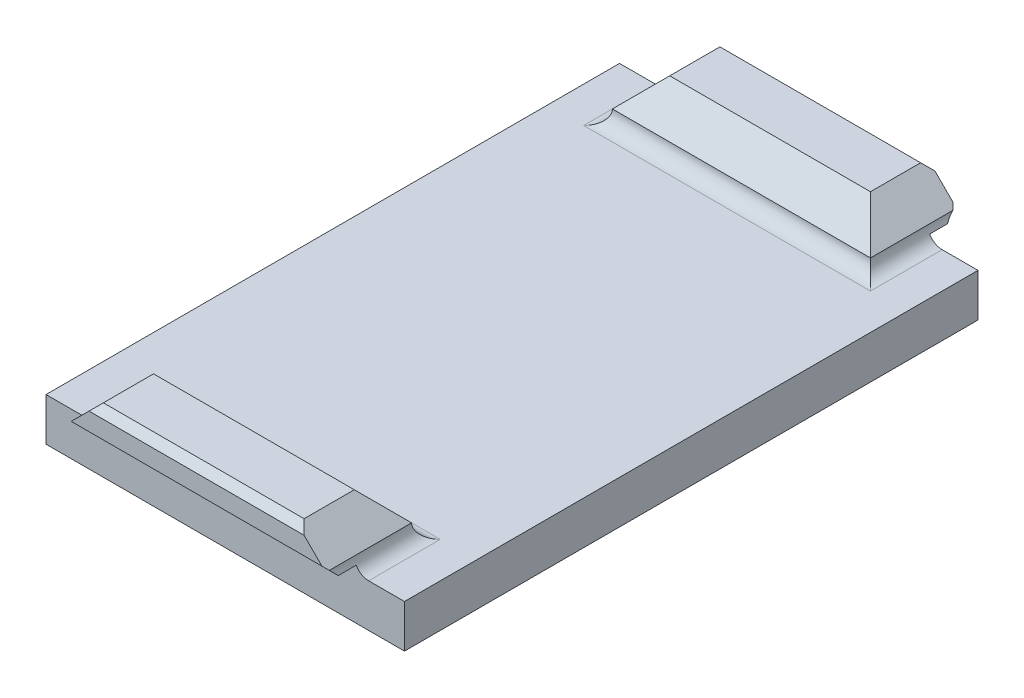
ISO-10303-21;
HEADER;
FILE_DESCRIPTION(('STEP AP214'),'2;1');
FILE_NAME('part.step','',(''),(''),'','','');
FILE_SCHEMA(('AUTOMOTIVE_DESIGN { 1 0 10303 214 1 1 1 1 }'));
ENDSEC;
DATA;
#1=APPLICATION_CONTEXT('core data for automotive mechanical design processes');
#2=APPLICATION_PROTOCOL_DEFINITION('international standard','automotive_design',2000,#1);
#3=PRODUCT_CONTEXT('',#1,'mechanical');
#4=PRODUCT('Part','Part','',(#3));
#5=PRODUCT_RELATED_PRODUCT_CATEGORY('part','',(#4));
#6=PRODUCT_DEFINITION_FORMATION('','',#4);
#7=PRODUCT_DEFINITION_CONTEXT('part definition',#1,'design');
#8=PRODUCT_DEFINITION('design','',#6,#7);
#9=PRODUCT_DEFINITION_SHAPE('','',#8);
#10=(LENGTH_UNIT() NAMED_UNIT(*) SI_UNIT(.MILLI.,.METRE.));
#11=(NAMED_UNIT(*) PLANE_ANGLE_UNIT() SI_UNIT($,.RADIAN.));
#12=(NAMED_UNIT(*) SI_UNIT($,.STERADIAN.) SOLID_ANGLE_UNIT());
#13=UNCERTAINTY_MEASURE_WITH_UNIT(LENGTH_MEASURE(1.E-05),#10,'distance_accuracy_value','');
#14=(GEOMETRIC_REPRESENTATION_CONTEXT(3) GLOBAL_UNCERTAINTY_ASSIGNED_CONTEXT((#13)) GLOBAL_UNIT_ASSIGNED_CONTEXT((#10,
#11,#12)) REPRESENTATION_CONTEXT('',''));
#15=CARTESIAN_POINT('',(0.,0.,0.));
#16=DIRECTION('',(0.,0.,1.));
#17=DIRECTION('',(1.,0.,0.));
#18=AXIS2_PLACEMENT_3D('',#15,#16,#17);
#19=CARTESIAN_POINT('',(0.,0.,0.));
#20=DIRECTION('',(0.,0.,1.));
#21=DIRECTION('',(1.,0.,0.));
#22=AXIS2_PLACEMENT_3D('',#19,#20,#21);
#23=PLANE('',#22);
#24=DIRECTION('',(-1.,0.,0.));
#25=VECTOR('',#24,1.);
#26=CARTESIAN_POINT('',(4.42047040189125,18.8964718028757,0.));
#27=LINE('',#26,#25);
#28=CARTESIAN_POINT('',(4.55074060555032,18.8964718028757,0.));
#29=VERTEX_POINT('',#28);
#30=CARTESIAN_POINT('',(-13.7097998017678,18.8964718028757,0.));
#31=VERTEX_POINT('',#30);
#32=EDGE_CURVE('E265',#29,#31,#27,.T.);
#33=ORIENTED_EDGE('',*,*,#32,.F.);
#34=CARTESIAN_POINT('',(5.42047040189125,19.39,0.));
#35=DIRECTION('',(0.,0.,1.));
#36=DIRECTION('',(1.,0.,0.));
#37=AXIS2_PLACEMENT_3D('',#34,#35,#36);
#38=CIRCLE('',#37,1.);
#39=CARTESIAN_POINT('',(5.42047040189125,18.39,0.));
#40=VERTEX_POINT('',#39);
#41=EDGE_CURVE('E428',#29,#40,#38,.T.);
#42=ORIENTED_EDGE('',*,*,#41,.T.);
#43=DIRECTION('',(-1.,0.,0.));
#44=VECTOR('',#43,1.);
#45=CARTESIAN_POINT('',(-17.0795295981088,18.39,0.));
#46=LINE('',#45,#44);
#47=CARTESIAN_POINT('',(7.92047040189125,18.39,0.));
#48=VERTEX_POINT('',#47);
#49=EDGE_CURVE('E277',#48,#40,#46,.T.);
#50=ORIENTED_EDGE('',*,*,#49,.F.);
#51=DIRECTION('',(0.,1.,0.));
#52=VECTOR('',#51,1.);
#53=CARTESIAN_POINT('',(7.92047040189125,18.39,0.));
#54=LINE('',#53,#52);
#55=CARTESIAN_POINT('',(7.92047040189125,15.39,0.));
#56=VERTEX_POINT('',#55);
#57=EDGE_CURVE('E273',#56,#48,#54,.T.);
#58=ORIENTED_EDGE('',*,*,#57,.F.);
#59=DIRECTION('',(1.,0.,0.));
#60=VECTOR('',#59,1.);
#61=CARTESIAN_POINT('',(-17.0795295981088,15.39,0.));
#62=LINE('',#61,#60);
#63=CARTESIAN_POINT('',(-17.0795295981088,15.39,0.));
#64=VERTEX_POINT('',#63);
#65=EDGE_CURVE('E270',#64,#56,#62,.T.);
#66=ORIENTED_EDGE('',*,*,#65,.F.);
#67=DIRECTION('',(0.,-1.,0.));
#68=VECTOR('',#67,1.);
#69=CARTESIAN_POINT('',(-17.0795295981088,18.39,0.));
#70=LINE('',#69,#68);
#71=CARTESIAN_POINT('',(-17.0795295981088,18.39,0.));
#72=VERTEX_POINT('',#71);
#73=EDGE_CURVE('E212',#72,#64,#70,.T.);
#74=ORIENTED_EDGE('',*,*,#73,.F.);
#75=CARTESIAN_POINT('',(-14.5795295981088,18.39,0.));
#76=VERTEX_POINT('',#75);
#77=EDGE_CURVE('E276',#76,#72,#46,.T.);
#78=ORIENTED_EDGE('',*,*,#77,.F.);
#79=CARTESIAN_POINT('',(-14.5795295981088,19.39,0.));
#80=DIRECTION('',(0.,0.,1.));
#81=DIRECTION('',(1.,0.,0.));
#82=AXIS2_PLACEMENT_3D('',#79,#80,#81);
#83=CIRCLE('',#82,1.);
#84=EDGE_CURVE('E409',#76,#31,#83,.T.);
#85=ORIENTED_EDGE('',*,*,#84,.T.);
#86=EDGE_LOOP('',(#33,#42,#50,#58,#66,#74,#78,#85));
#87=FACE_BOUND('',#86,.T.);
#88=ADVANCED_FACE('F41',(#87),#23,.F.);
#89=CARTESIAN_POINT('',(-17.0795295981088,18.39,20.));
#90=DIRECTION('',(0.,-1.,0.));
#91=DIRECTION('',(0.,0.,-1.));
#92=AXIS2_PLACEMENT_3D('',#89,#90,#91);
#93=PLANE('',#92);
#94=DIRECTION('',(1.,0.,0.));
#95=VECTOR('',#94,1.);
#96=CARTESIAN_POINT('',(-13.5795295981088,18.39,5.));
#97=LINE('',#96,#95);
#98=CARTESIAN_POINT('',(5.42047040189125,18.39,5.));
#99=VERTEX_POINT('',#98);
#100=CARTESIAN_POINT('',(-14.5795295981088,18.39,5.));
#101=VERTEX_POINT('',#100);
#102=EDGE_CURVE('E403',#99,#101,#97,.F.);
#103=ORIENTED_EDGE('',*,*,#102,.T.);
#104=DIRECTION('',(0.,0.,1.));
#105=VECTOR('',#104,1.);
#106=CARTESIAN_POINT('',(-14.5795295981088,18.39,0.));
#107=LINE('',#106,#105);
#108=EDGE_CURVE('E406',#101,#76,#107,.F.);
#109=ORIENTED_EDGE('',*,*,#108,.T.);
#110=ORIENTED_EDGE('',*,*,#77,.T.);
#111=DIRECTION('',(0.,0.,-1.));
#112=VECTOR('',#111,1.);
#113=CARTESIAN_POINT('',(-17.0795295981088,18.39,20.));
#114=LINE('',#113,#112);
#115=CARTESIAN_POINT('',(-17.0795295981088,18.39,40.));
#116=VERTEX_POINT('',#115);
#117=EDGE_CURVE('E281',#116,#72,#114,.T.);
#118=ORIENTED_EDGE('',*,*,#117,.F.);
#119=DIRECTION('',(-1.,0.,0.));
#120=VECTOR('',#119,1.);
#121=CARTESIAN_POINT('',(-17.0795295981088,18.39,40.));
#122=LINE('',#121,#120);
#123=CARTESIAN_POINT('',(-14.5795295981088,18.39,40.));
#124=VERTEX_POINT('',#123);
#125=EDGE_CURVE('E229',#124,#116,#122,.T.);
#126=ORIENTED_EDGE('',*,*,#125,.F.);
#127=DIRECTION('',(0.,0.,-1.));
#128=VECTOR('',#127,1.);
#129=CARTESIAN_POINT('',(-14.5795295981088,18.39,36.));
#130=LINE('',#129,#128);
#131=CARTESIAN_POINT('',(-14.5795295981088,18.39,35.));
#132=VERTEX_POINT('',#131);
#133=EDGE_CURVE('E390',#124,#132,#130,.T.);
#134=ORIENTED_EDGE('',*,*,#133,.T.);
#135=DIRECTION('',(1.,0.,0.));
#136=VECTOR('',#135,1.);
#137=CARTESIAN_POINT('',(4.42047040189125,18.39,35.));
#138=LINE('',#137,#136);
#139=CARTESIAN_POINT('',(5.42047040189125,18.39,35.));
#140=VERTEX_POINT('',#139);
#141=EDGE_CURVE('E393',#132,#140,#138,.T.);
#142=ORIENTED_EDGE('',*,*,#141,.T.);
#143=DIRECTION('',(0.,0.,1.));
#144=VECTOR('',#143,1.);
#145=CARTESIAN_POINT('',(5.42047040189125,18.39,40.));
#146=LINE('',#145,#144);
#147=CARTESIAN_POINT('',(5.42047040189125,18.39,40.));
#148=VERTEX_POINT('',#147);
#149=EDGE_CURVE('E397',#140,#148,#146,.T.);
#150=ORIENTED_EDGE('',*,*,#149,.T.);
#151=CARTESIAN_POINT('',(7.92047040189125,18.39,40.));
#152=VERTEX_POINT('',#151);
#153=EDGE_CURVE('E239',#152,#148,#122,.T.);
#154=ORIENTED_EDGE('',*,*,#153,.F.);
#155=DIRECTION('',(0.,0.,-1.));
#156=VECTOR('',#155,1.);
#157=CARTESIAN_POINT('',(7.92047040189125,18.39,20.));
#158=LINE('',#157,#156);
#159=EDGE_CURVE('E284',#152,#48,#158,.T.);
#160=ORIENTED_EDGE('',*,*,#159,.T.);
#161=ORIENTED_EDGE('',*,*,#49,.T.);
#162=DIRECTION('',(0.,0.,-1.));
#163=VECTOR('',#162,1.);
#164=CARTESIAN_POINT('',(5.42047040189125,18.39,4.));
#165=LINE('',#164,#163);
#166=EDGE_CURVE('E400',#40,#99,#165,.F.);
#167=ORIENTED_EDGE('',*,*,#166,.T.);
#168=EDGE_LOOP('',(#103,#109,#110,#118,#126,#134,#142,#150,#154,#160,#161,#167));
#169=FACE_BOUND('',#168,.T.);
#170=ADVANCED_FACE('F490',(#169),#93,.F.);
#171=CARTESIAN_POINT('',(-17.0795295981088,18.39,20.));
#172=DIRECTION('',(1.,0.,0.));
#173=DIRECTION('',(0.,0.,-1.));
#174=AXIS2_PLACEMENT_3D('',#171,#172,#173);
#175=PLANE('',#174);
#176=ORIENTED_EDGE('',*,*,#73,.T.);
#177=DIRECTION('',(0.,0.,-1.));
#178=VECTOR('',#177,1.);
#179=CARTESIAN_POINT('',(-17.0795295981088,15.39,20.));
#180=LINE('',#179,#178);
#181=CARTESIAN_POINT('',(-17.0795295981088,15.39,40.));
#182=VERTEX_POINT('',#181);
#183=EDGE_CURVE('E205',#182,#64,#180,.T.);
#184=ORIENTED_EDGE('',*,*,#183,.F.);
#185=DIRECTION('',(0.,-1.,0.));
#186=VECTOR('',#185,1.);
#187=CARTESIAN_POINT('',(-17.0795295981088,18.39,40.));
#188=LINE('',#187,#186);
#189=EDGE_CURVE('E210',#116,#182,#188,.T.);
#190=ORIENTED_EDGE('',*,*,#189,.F.);
#191=ORIENTED_EDGE('',*,*,#117,.T.);
#192=EDGE_LOOP('',(#176,#184,#190,#191));
#193=FACE_BOUND('',#192,.T.);
#194=ADVANCED_FACE('F207',(#193),#175,.F.);
#195=CARTESIAN_POINT('',(-17.0795295981088,15.39,20.));
#196=DIRECTION('',(0.,1.,0.));
#197=DIRECTION('',(-1.,0.,0.));
#198=AXIS2_PLACEMENT_3D('',#195,#196,#197);
#199=PLANE('',#198);
#200=ORIENTED_EDGE('',*,*,#65,.T.);
#201=DIRECTION('',(0.,0.,-1.));
#202=VECTOR('',#201,1.);
#203=CARTESIAN_POINT('',(7.92047040189125,15.39,20.));
#204=LINE('',#203,#202);
#205=CARTESIAN_POINT('',(7.92047040189125,15.39,40.));
#206=VERTEX_POINT('',#205);
#207=EDGE_CURVE('E216',#206,#56,#204,.T.);
#208=ORIENTED_EDGE('',*,*,#207,.F.);
#209=DIRECTION('',(1.,0.,0.));
#210=VECTOR('',#209,1.);
#211=CARTESIAN_POINT('',(-17.0795295981088,15.39,40.));
#212=LINE('',#211,#210);
#213=EDGE_CURVE('E219',#182,#206,#212,.T.);
#214=ORIENTED_EDGE('',*,*,#213,.F.);
#215=ORIENTED_EDGE('',*,*,#183,.T.);
#216=EDGE_LOOP('',(#200,#208,#214,#215));
#217=FACE_BOUND('',#216,.T.);
#218=ADVANCED_FACE('F220',(#217),#199,.F.);
#219=CARTESIAN_POINT('',(7.92047040189125,18.39,20.));
#220=DIRECTION('',(-1.,0.,0.));
#221=DIRECTION('',(0.,0.,1.));
#222=AXIS2_PLACEMENT_3D('',#219,#220,#221);
#223=PLANE('',#222);
#224=ORIENTED_EDGE('',*,*,#57,.T.);
#225=ORIENTED_EDGE('',*,*,#159,.F.);
#226=DIRECTION('',(0.,1.,0.));
#227=VECTOR('',#226,1.);
#228=CARTESIAN_POINT('',(7.92047040189125,18.39,40.));
#229=LINE('',#228,#227);
#230=EDGE_CURVE('E225',#206,#152,#229,.T.);
#231=ORIENTED_EDGE('',*,*,#230,.F.);
#232=ORIENTED_EDGE('',*,*,#207,.T.);
#233=EDGE_LOOP('',(#224,#225,#231,#232));
#234=FACE_BOUND('',#233,.T.);
#235=ADVANCED_FACE('F500',(#234),#223,.F.);
#236=CARTESIAN_POINT('',(0.,21.39,0.));
#237=DIRECTION('',(0.,1.,0.));
#238=DIRECTION('',(0.,0.,1.));
#239=AXIS2_PLACEMENT_3D('',#236,#237,#238);
#240=PLANE('',#239);
#241=DIRECTION('',(1.,0.,0.));
#242=VECTOR('',#241,1.);
#243=CARTESIAN_POINT('',(4.42047040189125,21.39,1.99999999999999));
#244=LINE('',#243,#242);
#245=CARTESIAN_POINT('',(-11.5795295981088,21.39,1.99999999999999));
#246=VERTEX_POINT('',#245);
#247=CARTESIAN_POINT('',(2.42047040189124,21.39,1.99999999999999));
#248=VERTEX_POINT('',#247);
#249=EDGE_CURVE('E304',#246,#248,#244,.T.);
#250=ORIENTED_EDGE('',*,*,#249,.T.);
#251=DIRECTION('',(0.,0.,-1.));
#252=VECTOR('',#251,1.);
#253=CARTESIAN_POINT('',(2.42047040189124,21.39,-1.5));
#254=LINE('',#253,#252);
#255=CARTESIAN_POINT('',(2.42047040189124,21.39,-1.5));
#256=VERTEX_POINT('',#255);
#257=EDGE_CURVE('E354',#248,#256,#254,.T.);
#258=ORIENTED_EDGE('',*,*,#257,.T.);
#259=DIRECTION('',(-1.,0.,0.));
#260=VECTOR('',#259,1.);
#261=CARTESIAN_POINT('',(0.,21.39,-1.5));
#262=LINE('',#261,#260);
#263=CARTESIAN_POINT('',(-11.5795295981088,21.39,-1.5));
#264=VERTEX_POINT('',#263);
#265=EDGE_CURVE('E300',#256,#264,#262,.T.);
#266=ORIENTED_EDGE('',*,*,#265,.T.);
#267=DIRECTION('',(0.,0.,1.));
#268=VECTOR('',#267,1.);
#269=CARTESIAN_POINT('',(-11.5795295981088,21.39,1.99999999999999));
#270=LINE('',#269,#268);
#271=EDGE_CURVE('E350',#264,#246,#270,.T.);
#272=ORIENTED_EDGE('',*,*,#271,.T.);
#273=EDGE_LOOP('',(#250,#258,#266,#272));
#274=FACE_BOUND('',#273,.T.);
#275=ADVANCED_FACE('F535',(#274),#240,.T.);
#276=CARTESIAN_POINT('',(4.42047040189125,18.8964718028757,-2.));
#277=DIRECTION('',(0.,1.,0.));
#278=DIRECTION('',(0.,0.,1.));
#279=AXIS2_PLACEMENT_3D('',#276,#277,#278);
#280=PLANE('',#279);
#281=ORIENTED_EDGE('',*,*,#32,.T.);
#282=DIRECTION('',(0.,0.,-1.));
#283=VECTOR('',#282,1.);
#284=CARTESIAN_POINT('',(-13.7097998017678,18.8964718028757,0.));
#285=LINE('',#284,#283);
#286=CARTESIAN_POINT('',(-13.7097998017678,18.8964718028757,-1.25));
#287=VERTEX_POINT('',#286);
#288=EDGE_CURVE('E413',#31,#287,#285,.T.);
#289=ORIENTED_EDGE('',*,*,#288,.T.);
#290=DIRECTION('',(1.,0.,0.));
#291=VECTOR('',#290,1.);
#292=CARTESIAN_POINT('',(4.42047040189125,18.8964718028757,-1.25));
#293=LINE('',#292,#291);
#294=CARTESIAN_POINT('',(4.55074060555032,18.8964718028757,-1.25));
#295=VERTEX_POINT('',#294);
#296=EDGE_CURVE('E293',#287,#295,#293,.T.);
#297=ORIENTED_EDGE('',*,*,#296,.T.);
#298=DIRECTION('',(0.,0.,1.));
#299=VECTOR('',#298,1.);
#300=CARTESIAN_POINT('',(4.55074060555032,18.8964718028757,-1.25));
#301=LINE('',#300,#299);
#302=EDGE_CURVE('E424',#295,#29,#301,.T.);
#303=ORIENTED_EDGE('',*,*,#302,.T.);
#304=EDGE_LOOP('',(#281,#289,#297,#303));
#305=FACE_BOUND('',#304,.T.);
#306=ADVANCED_FACE('F519',(#305),#280,.F.);
#307=CARTESIAN_POINT('',(0.,0.,-2.));
#308=DIRECTION('',(0.,0.,-1.));
#309=DIRECTION('',(-1.,0.,0.));
#310=AXIS2_PLACEMENT_3D('',#307,#308,#309);
#311=PLANE('',#310);
#312=DIRECTION('',(1.,0.,0.));
#313=VECTOR('',#312,1.);
#314=CARTESIAN_POINT('',(0.,20.89,-2.));
#315=LINE('',#314,#313);
#316=CARTESIAN_POINT('',(-12.0795295981088,20.89,-2.));
#317=VERTEX_POINT('',#316);
#318=CARTESIAN_POINT('',(2.92047040189124,20.89,-2.));
#319=VERTEX_POINT('',#318);
#320=EDGE_CURVE('E296',#317,#319,#315,.T.);
#321=ORIENTED_EDGE('',*,*,#320,.T.);
#322=DIRECTION('',(0.707106781186546,-0.707106781186549,0.));
#323=VECTOR('',#322,1.);
#324=CARTESIAN_POINT('',(11.9052352009456,11.9052352009456,-2.));
#325=LINE('',#324,#323);
#326=CARTESIAN_POINT('',(4.16399859901554,19.6464718028757,-2.));
#327=VERTEX_POINT('',#326);
#328=EDGE_CURVE('E367',#319,#327,#325,.T.);
#329=ORIENTED_EDGE('',*,*,#328,.T.);
#330=DIRECTION('',(-1.,0.,0.));
#331=VECTOR('',#330,1.);
#332=CARTESIAN_POINT('',(-13.5795295981088,19.6464718028757,-2.));
#333=LINE('',#332,#331);
#334=CARTESIAN_POINT('',(-13.3230577952331,19.6464718028757,-2.));
#335=VERTEX_POINT('',#334);
#336=EDGE_CURVE('E215',#327,#335,#333,.T.);
#337=ORIENTED_EDGE('',*,*,#336,.T.);
#338=DIRECTION('',(0.707106781186546,0.707106781186549,0.));
#339=VECTOR('',#338,1.);
#340=CARTESIAN_POINT('',(-16.4847647990544,16.4847647990543,-2.));
#341=LINE('',#340,#339);
#342=EDGE_CURVE('E364',#335,#317,#341,.T.);
#343=ORIENTED_EDGE('',*,*,#342,.T.);
#344=EDGE_LOOP('',(#321,#329,#337,#343));
#345=FACE_BOUND('',#344,.T.);
#346=ADVANCED_FACE('F546',(#345),#311,.T.);
#347=CARTESIAN_POINT('',(0.,19.6464718028757,-2.));
#348=DIRECTION('',(0.,-0.707106781186549,-0.707106781186546));
#349=DIRECTION('',(1.,0.,0.));
#350=AXIS2_PLACEMENT_3D('',#347,#348,#349);
#351=PLANE('',#350);
#352=ORIENTED_EDGE('',*,*,#336,.F.);
#353=DIRECTION('',(0.577350269189624,-0.577350269189626,0.577350269189628));
#354=VECTOR('',#353,1.);
#355=CARTESIAN_POINT('',(2.77599906601037,21.0344713358809,-3.38799953300518));
#356=LINE('',#355,#354);
#357=CARTESIAN_POINT('',(4.42047040189125,19.39,-1.74352819712429));
#358=VERTEX_POINT('',#357);
#359=EDGE_CURVE('E373',#327,#358,#356,.T.);
#360=ORIENTED_EDGE('',*,*,#359,.T.);
#361=CARTESIAN_POINT('',(5.42047040189125,19.39,-1.7435281971243));
#362=DIRECTION('',(0.,-0.707106781186549,-0.707106781186546));
#363=DIRECTION('',(0.,-0.707106781186546,0.707106781186549));
#364=AXIS2_PLACEMENT_3D('',#361,#362,#363);
#365=ELLIPSE('',#364,1.4142135623731,1.);
#366=EDGE_CURVE('E420',#358,#295,#365,.F.);
#367=ORIENTED_EDGE('',*,*,#366,.T.);
#368=ORIENTED_EDGE('',*,*,#296,.F.);
#369=CARTESIAN_POINT('',(-14.5795295981088,19.39,-1.7435281971243));
#370=DIRECTION('',(0.,-0.707106781186549,-0.707106781186546));
#371=DIRECTION('',(0.,0.707106781186546,-0.707106781186549));
#372=AXIS2_PLACEMENT_3D('',#369,#370,#371);
#373=ELLIPSE('',#372,1.4142135623731,1.);
#374=CARTESIAN_POINT('',(-13.5795295981088,19.39,-1.7435281971243));
#375=VERTEX_POINT('',#374);
#376=EDGE_CURVE('E417',#287,#375,#373,.F.);
#377=ORIENTED_EDGE('',*,*,#376,.T.);
#378=DIRECTION('',(0.577350269189623,0.577350269189626,-0.577350269189628));
#379=VECTOR('',#378,1.);
#380=CARTESIAN_POINT('',(-8.88203853015541,24.0874910679533,-6.44101926507769));
#381=LINE('',#380,#379);
#382=EDGE_CURVE('E370',#375,#335,#381,.T.);
#383=ORIENTED_EDGE('',*,*,#382,.T.);
#384=EDGE_LOOP('',(#352,#360,#367,#368,#377,#383));
#385=FACE_BOUND('',#384,.T.);
#386=ADVANCED_FACE('F522',(#385),#351,.T.);
#387=CARTESIAN_POINT('',(0.,20.89,-2.));
#388=DIRECTION('',(0.,-0.70710678118655,0.707106781186545));
#389=DIRECTION('',(1.,0.,0.));
#390=AXIS2_PLACEMENT_3D('',#387,#388,#389);
#391=PLANE('',#390);
#392=ORIENTED_EDGE('',*,*,#265,.F.);
#393=DIRECTION('',(-0.577350269189623,0.577350269189625,0.577350269189629));
#394=VECTOR('',#393,1.);
#395=CARTESIAN_POINT('',(1.9469802679275,21.8634901339637,-1.02650986603625));
#396=LINE('',#395,#394);
#397=EDGE_CURVE('E361',#256,#319,#396,.F.);
#398=ORIENTED_EDGE('',*,*,#397,.T.);
#399=ORIENTED_EDGE('',*,*,#320,.F.);
#400=DIRECTION('',(-0.577350269189623,-0.577350269189625,-0.577350269189629));
#401=VECTOR('',#400,1.);
#402=CARTESIAN_POINT('',(-8.05301973207254,24.9165098660362,2.02650986603626));
#403=LINE('',#402,#401);
#404=EDGE_CURVE('E358',#317,#264,#403,.F.);
#405=ORIENTED_EDGE('',*,*,#404,.T.);
#406=EDGE_LOOP('',(#392,#398,#399,#405));
#407=FACE_BOUND('',#406,.T.);
#408=ADVANCED_FACE('F538',(#407),#391,.F.);
#409=CARTESIAN_POINT('',(0.,21.39,1.99999999999999));
#410=DIRECTION('',(0.,0.707106781186546,0.707106781186549));
#411=DIRECTION('',(-1.,0.,0.));
#412=AXIS2_PLACEMENT_3D('',#409,#410,#411);
#413=PLANE('',#412);
#414=DIRECTION('',(-1.,0.,0.));
#415=VECTOR('',#414,1.);
#416=CARTESIAN_POINT('',(-13.5795295981088,19.39,4.));
#417=LINE('',#416,#415);
#418=CARTESIAN_POINT('',(4.42047040189125,19.39,4.));
#419=VERTEX_POINT('',#418);
#420=CARTESIAN_POINT('',(-13.5795295981088,19.39,4.));
#421=VERTEX_POINT('',#420);
#422=EDGE_CURVE('E308',#419,#421,#417,.T.);
#423=ORIENTED_EDGE('',*,*,#422,.F.);
#424=DIRECTION('',(-0.577350269189625,0.577350269189627,-0.577350269189625));
#425=VECTOR('',#424,1.);
#426=CARTESIAN_POINT('',(1.61364693459416,22.1968234672971,1.19317653270292));
#427=LINE('',#426,#425);
#428=EDGE_CURVE('E383',#419,#248,#427,.T.);
#429=ORIENTED_EDGE('',*,*,#428,.T.);
#430=ORIENTED_EDGE('',*,*,#249,.F.);
#431=DIRECTION('',(-0.577350269189625,-0.577350269189627,0.577350269189625));
#432=VECTOR('',#431,1.);
#433=CARTESIAN_POINT('',(-7.71968639873918,25.2498431993696,-1.85984319936958));
#434=LINE('',#433,#432);
#435=EDGE_CURVE('E380',#246,#421,#434,.T.);
#436=ORIENTED_EDGE('',*,*,#435,.T.);
#437=EDGE_LOOP('',(#423,#429,#430,#436));
#438=FACE_BOUND('',#437,.T.);
#439=ADVANCED_FACE('F528',(#438),#413,.T.);
#440=CARTESIAN_POINT('',(0.,0.,40.));
#441=DIRECTION('',(0.,0.,-1.));
#442=DIRECTION('',(1.,0.,0.));
#443=AXIS2_PLACEMENT_3D('',#440,#441,#442);
#444=PLANE('',#443);
#445=DIRECTION('',(-1.,0.,0.));
#446=VECTOR('',#445,1.);
#447=CARTESIAN_POINT('',(4.42047040189125,18.8964718028757,40.));
#448=LINE('',#447,#446);
#449=CARTESIAN_POINT('',(4.55074060555032,18.8964718028757,40.));
#450=VERTEX_POINT('',#449);
#451=CARTESIAN_POINT('',(-13.7097998017678,18.8964718028757,40.));
#452=VERTEX_POINT('',#451);
#453=EDGE_CURVE('E58',#450,#452,#448,.T.);
#454=ORIENTED_EDGE('',*,*,#453,.T.);
#455=CARTESIAN_POINT('',(-14.5795295981088,19.39,40.));
#456=DIRECTION('',(0.,0.,-1.));
#457=DIRECTION('',(-1.,0.,0.));
#458=AXIS2_PLACEMENT_3D('',#455,#456,#457);
#459=CIRCLE('',#458,1.);
#460=EDGE_CURVE('E11',#452,#124,#459,.T.);
#461=ORIENTED_EDGE('',*,*,#460,.T.);
#462=ORIENTED_EDGE('',*,*,#125,.T.);
#463=ORIENTED_EDGE('',*,*,#189,.T.);
#464=ORIENTED_EDGE('',*,*,#213,.T.);
#465=ORIENTED_EDGE('',*,*,#230,.T.);
#466=ORIENTED_EDGE('',*,*,#153,.T.);
#467=CARTESIAN_POINT('',(5.42047040189125,19.39,40.));
#468=DIRECTION('',(0.,0.,-1.));
#469=DIRECTION('',(-1.,0.,0.));
#470=AXIS2_PLACEMENT_3D('',#467,#468,#469);
#471=CIRCLE('',#470,1.);
#472=EDGE_CURVE('E431',#148,#450,#471,.T.);
#473=ORIENTED_EDGE('',*,*,#472,.T.);
#474=EDGE_LOOP('',(#454,#461,#462,#463,#464,#465,#466,#473));
#475=FACE_BOUND('',#474,.T.);
#476=ADVANCED_FACE('F227',(#475),#444,.F.);
#477=CARTESIAN_POINT('',(0.,21.39,40.));
#478=DIRECTION('',(0.,1.,0.));
#479=DIRECTION('',(0.,0.,-1.));
#480=AXIS2_PLACEMENT_3D('',#477,#478,#479);
#481=PLANE('',#480);
#482=DIRECTION('',(-1.,0.,0.));
#483=VECTOR('',#482,1.);
#484=CARTESIAN_POINT('',(0.,21.39,41.5));
#485=LINE('',#484,#483);
#486=CARTESIAN_POINT('',(2.42047040189124,21.39,41.5));
#487=VERTEX_POINT('',#486);
#488=CARTESIAN_POINT('',(-11.5795295981087,21.39,41.5));
#489=VERTEX_POINT('',#488);
#490=EDGE_CURVE('E253',#487,#489,#485,.T.);
#491=ORIENTED_EDGE('',*,*,#490,.F.);
#492=DIRECTION('',(0.,0.,-1.));
#493=VECTOR('',#492,1.);
#494=CARTESIAN_POINT('',(2.42047040189124,21.39,38.));
#495=LINE('',#494,#493);
#496=CARTESIAN_POINT('',(2.42047040189124,21.39,38.));
#497=VERTEX_POINT('',#496);
#498=EDGE_CURVE('E337',#487,#497,#495,.T.);
#499=ORIENTED_EDGE('',*,*,#498,.T.);
#500=DIRECTION('',(1.,0.,0.));
#501=VECTOR('',#500,1.);
#502=CARTESIAN_POINT('',(4.42047040189125,21.39,38.));
#503=LINE('',#502,#501);
#504=CARTESIAN_POINT('',(-11.5795295981087,21.39,38.));
#505=VERTEX_POINT('',#504);
#506=EDGE_CURVE('E257',#505,#497,#503,.T.);
#507=ORIENTED_EDGE('',*,*,#506,.F.);
#508=DIRECTION('',(0.,0.,1.));
#509=VECTOR('',#508,1.);
#510=CARTESIAN_POINT('',(-11.5795295981087,21.39,41.5));
#511=LINE('',#510,#509);
#512=EDGE_CURVE('E334',#505,#489,#511,.T.);
#513=ORIENTED_EDGE('',*,*,#512,.T.);
#514=EDGE_LOOP('',(#491,#499,#507,#513));
#515=FACE_BOUND('',#514,.T.);
#516=ADVANCED_FACE('F681',(#515),#481,.T.);
#517=CARTESIAN_POINT('',(4.42047040189125,18.8964718028757,42.));
#518=DIRECTION('',(0.,1.,0.));
#519=DIRECTION('',(0.,0.,-1.));
#520=AXIS2_PLACEMENT_3D('',#517,#518,#519);
#521=PLANE('',#520);
#522=DIRECTION('',(1.,0.,0.));
#523=VECTOR('',#522,1.);
#524=CARTESIAN_POINT('',(4.42047040189125,18.8964718028757,41.25));
#525=LINE('',#524,#523);
#526=CARTESIAN_POINT('',(-13.7097998017678,18.8964718028757,41.25));
#527=VERTEX_POINT('',#526);
#528=CARTESIAN_POINT('',(4.55074060555032,18.8964718028757,41.25));
#529=VERTEX_POINT('',#528);
#530=EDGE_CURVE('E65',#527,#529,#525,.T.);
#531=ORIENTED_EDGE('',*,*,#530,.F.);
#532=DIRECTION('',(0.,0.,1.));
#533=VECTOR('',#532,1.);
#534=CARTESIAN_POINT('',(-13.7097998017678,18.8964718028757,41.25));
#535=LINE('',#534,#533);
#536=EDGE_CURVE('E51',#527,#452,#535,.F.);
#537=ORIENTED_EDGE('',*,*,#536,.T.);
#538=ORIENTED_EDGE('',*,*,#453,.F.);
#539=DIRECTION('',(0.,0.,-1.));
#540=VECTOR('',#539,1.);
#541=CARTESIAN_POINT('',(4.55074060555032,18.8964718028757,40.));
#542=LINE('',#541,#540);
#543=EDGE_CURVE('E434',#450,#529,#542,.F.);
#544=ORIENTED_EDGE('',*,*,#543,.T.);
#545=EDGE_LOOP('',(#531,#537,#538,#544));
#546=FACE_BOUND('',#545,.T.);
#547=ADVANCED_FACE('F673',(#546),#521,.F.);
#548=CARTESIAN_POINT('',(0.,0.,42.));
#549=DIRECTION('',(0.,0.,1.));
#550=DIRECTION('',(-1.,0.,0.));
#551=AXIS2_PLACEMENT_3D('',#548,#549,#550);
#552=PLANE('',#551);
#553=DIRECTION('',(-1.,0.,0.));
#554=VECTOR('',#553,1.);
#555=CARTESIAN_POINT('',(-13.5795295981088,19.6464718028757,42.));
#556=LINE('',#555,#554);
#557=CARTESIAN_POINT('',(4.16399859901555,19.6464718028757,42.));
#558=VERTEX_POINT('',#557);
#559=CARTESIAN_POINT('',(-13.3230577952331,19.6464718028757,42.));
#560=VERTEX_POINT('',#559);
#561=EDGE_CURVE('E243',#558,#560,#556,.T.);
#562=ORIENTED_EDGE('',*,*,#561,.F.);
#563=DIRECTION('',(-0.707106781186549,0.707106781186546,0.));
#564=VECTOR('',#563,1.);
#565=CARTESIAN_POINT('',(11.9052352009456,11.9052352009457,42.));
#566=LINE('',#565,#564);
#567=CARTESIAN_POINT('',(2.92047040189124,20.89,42.));
#568=VERTEX_POINT('',#567);
#569=EDGE_CURVE('E325',#558,#568,#566,.T.);
#570=ORIENTED_EDGE('',*,*,#569,.T.);
#571=DIRECTION('',(1.,0.,0.));
#572=VECTOR('',#571,1.);
#573=CARTESIAN_POINT('',(0.,20.89,42.));
#574=LINE('',#573,#572);
#575=CARTESIAN_POINT('',(-12.0795295981087,20.89,42.));
#576=VERTEX_POINT('',#575);
#577=EDGE_CURVE('E249',#576,#568,#574,.T.);
#578=ORIENTED_EDGE('',*,*,#577,.F.);
#579=DIRECTION('',(-0.707106781186549,-0.707106781186546,0.));
#580=VECTOR('',#579,1.);
#581=CARTESIAN_POINT('',(-16.4847647990543,16.4847647990544,42.));
#582=LINE('',#581,#580);
#583=EDGE_CURVE('E322',#576,#560,#582,.T.);
#584=ORIENTED_EDGE('',*,*,#583,.T.);
#585=EDGE_LOOP('',(#562,#570,#578,#584));
#586=FACE_BOUND('',#585,.T.);
#587=ADVANCED_FACE('F665',(#586),#552,.T.);
#588=CARTESIAN_POINT('',(0.,19.6464718028757,42.));
#589=DIRECTION('',(0.,-0.707106781186549,0.707106781186546));
#590=DIRECTION('',(1.,0.,0.));
#591=AXIS2_PLACEMENT_3D('',#588,#589,#590);
#592=PLANE('',#591);
#593=ORIENTED_EDGE('',*,*,#530,.T.);
#594=CARTESIAN_POINT('',(5.42047040189125,19.39,41.7435281971243));
#595=DIRECTION('',(0.,-0.707106781186549,0.707106781186546));
#596=DIRECTION('',(0.,-0.707106781186546,-0.707106781186549));
#597=AXIS2_PLACEMENT_3D('',#594,#595,#596);
#598=ELLIPSE('',#597,1.4142135623731,1.);
#599=CARTESIAN_POINT('',(4.42047040189125,19.39,41.7435281971243));
#600=VERTEX_POINT('',#599);
#601=EDGE_CURVE('E437',#529,#600,#598,.F.);
#602=ORIENTED_EDGE('',*,*,#601,.T.);
#603=DIRECTION('',(-0.577350269189626,0.577350269189624,0.577350269189627));
#604=VECTOR('',#603,1.);
#605=CARTESIAN_POINT('',(2.77599906601036,21.0344713358809,43.3879995330052));
#606=LINE('',#605,#604);
#607=EDGE_CURVE('E319',#600,#558,#606,.T.);
#608=ORIENTED_EDGE('',*,*,#607,.T.);
#609=ORIENTED_EDGE('',*,*,#561,.T.);
#610=DIRECTION('',(-0.577350269189626,-0.577350269189624,-0.577350269189627));
#611=VECTOR('',#610,1.);
#612=CARTESIAN_POINT('',(-8.88203853015536,24.0874910679534,46.4410192650777));
#613=LINE('',#612,#611);
#614=CARTESIAN_POINT('',(-13.5795295981088,19.39,41.7435281971243));
#615=VERTEX_POINT('',#614);
#616=EDGE_CURVE('E316',#560,#615,#613,.T.);
#617=ORIENTED_EDGE('',*,*,#616,.T.);
#618=CARTESIAN_POINT('',(-14.5795295981088,19.39,41.7435281971243));
#619=DIRECTION('',(0.,-0.707106781186549,0.707106781186546));
#620=DIRECTION('',(0.,0.707106781186546,0.707106781186549));
#621=AXIS2_PLACEMENT_3D('',#618,#619,#620);
#622=ELLIPSE('',#621,1.4142135623731,1.);
#623=EDGE_CURVE('E440',#615,#527,#622,.F.);
#624=ORIENTED_EDGE('',*,*,#623,.T.);
#625=EDGE_LOOP('',(#593,#602,#608,#609,#617,#624));
#626=FACE_BOUND('',#625,.T.);
#627=ADVANCED_FACE('F657',(#626),#592,.T.);
#628=CARTESIAN_POINT('',(0.,20.89,42.));
#629=DIRECTION('',(0.,-0.70710678118655,-0.707106781186545));
#630=DIRECTION('',(1.,0.,0.));
#631=AXIS2_PLACEMENT_3D('',#628,#629,#630);
#632=PLANE('',#631);
#633=ORIENTED_EDGE('',*,*,#577,.T.);
#634=DIRECTION('',(0.577350269189626,-0.577350269189624,0.577350269189628));
#635=VECTOR('',#634,1.);
#636=CARTESIAN_POINT('',(1.94698026792749,21.8634901339637,41.0265098660362));
#637=LINE('',#636,#635);
#638=EDGE_CURVE('E331',#568,#487,#637,.F.);
#639=ORIENTED_EDGE('',*,*,#638,.T.);
#640=ORIENTED_EDGE('',*,*,#490,.T.);
#641=DIRECTION('',(0.577350269189626,0.577350269189624,-0.577350269189628));
#642=VECTOR('',#641,1.);
#643=CARTESIAN_POINT('',(-8.0530197320725,24.9165098660362,37.9734901339637));
#644=LINE('',#643,#642);
#645=EDGE_CURVE('E328',#489,#576,#644,.F.);
#646=ORIENTED_EDGE('',*,*,#645,.T.);
#647=EDGE_LOOP('',(#633,#639,#640,#646));
#648=FACE_BOUND('',#647,.T.);
#649=ADVANCED_FACE('F650',(#648),#632,.F.);
#650=CARTESIAN_POINT('',(0.,21.39,38.));
#651=DIRECTION('',(0.,0.707106781186546,-0.707106781186549));
#652=DIRECTION('',(-1.,0.,0.));
#653=AXIS2_PLACEMENT_3D('',#650,#651,#652);
#654=PLANE('',#653);
#655=ORIENTED_EDGE('',*,*,#506,.T.);
#656=DIRECTION('',(0.577350269189628,-0.577350269189626,-0.577350269189624));
#657=VECTOR('',#656,1.);
#658=CARTESIAN_POINT('',(1.61364693459415,22.1968234672971,38.8068234672971));
#659=LINE('',#658,#657);
#660=CARTESIAN_POINT('',(4.42047040189125,19.39,36.));
#661=VERTEX_POINT('',#660);
#662=EDGE_CURVE('E343',#497,#661,#659,.T.);
#663=ORIENTED_EDGE('',*,*,#662,.T.);
#664=DIRECTION('',(-1.,0.,0.));
#665=VECTOR('',#664,1.);
#666=CARTESIAN_POINT('',(-13.5795295981088,19.39,36.));
#667=LINE('',#666,#665);
#668=CARTESIAN_POINT('',(-13.5795295981088,19.39,36.));
#669=VERTEX_POINT('',#668);
#670=EDGE_CURVE('E261',#661,#669,#667,.T.);
#671=ORIENTED_EDGE('',*,*,#670,.T.);
#672=DIRECTION('',(0.577350269189628,0.577350269189626,0.577350269189624));
#673=VECTOR('',#672,1.);
#674=CARTESIAN_POINT('',(-7.71968639873914,25.2498431993696,41.8598431993696));
#675=LINE('',#674,#673);
#676=EDGE_CURVE('E340',#669,#505,#675,.T.);
#677=ORIENTED_EDGE('',*,*,#676,.T.);
#678=EDGE_LOOP('',(#655,#663,#671,#677));
#679=FACE_BOUND('',#678,.T.);
#680=ADVANCED_FACE('F475',(#679),#654,.T.);
#681=CARTESIAN_POINT('',(4.42047040189125,19.39,40.));
#682=DIRECTION('',(0.707106781186546,0.707106781186549,0.));
#683=DIRECTION('',(0.,0.,-1.));
#684=AXIS2_PLACEMENT_3D('',#681,#682,#683);
#685=PLANE('',#684);
#686=ORIENTED_EDGE('',*,*,#662,.F.);
#687=ORIENTED_EDGE('',*,*,#498,.F.);
#688=ORIENTED_EDGE('',*,*,#638,.F.);
#689=ORIENTED_EDGE('',*,*,#569,.F.);
#690=ORIENTED_EDGE('',*,*,#607,.F.);
#691=DIRECTION('',(0.,0.,1.));
#692=VECTOR('',#691,1.);
#693=CARTESIAN_POINT('',(4.42047040189125,19.39,41.5));
#694=LINE('',#693,#692);
#695=EDGE_CURVE('E312',#661,#600,#694,.T.);
#696=ORIENTED_EDGE('',*,*,#695,.F.);
#697=EDGE_LOOP('',(#686,#687,#688,#689,#690,#696));
#698=FACE_BOUND('',#697,.T.);
#699=ADVANCED_FACE('F481',(#698),#685,.T.);
#700=CARTESIAN_POINT('',(-13.5795295981088,19.39,40.));
#701=DIRECTION('',(-0.707106781186546,0.707106781186549,0.));
#702=DIRECTION('',(0.,0.,1.));
#703=AXIS2_PLACEMENT_3D('',#700,#701,#702);
#704=PLANE('',#703);
#705=ORIENTED_EDGE('',*,*,#645,.F.);
#706=ORIENTED_EDGE('',*,*,#512,.F.);
#707=ORIENTED_EDGE('',*,*,#676,.F.);
#708=DIRECTION('',(0.,0.,-1.));
#709=VECTOR('',#708,1.);
#710=CARTESIAN_POINT('',(-13.5795295981088,19.39,38.));
#711=LINE('',#710,#709);
#712=EDGE_CURVE('E346',#615,#669,#711,.T.);
#713=ORIENTED_EDGE('',*,*,#712,.F.);
#714=ORIENTED_EDGE('',*,*,#616,.F.);
#715=ORIENTED_EDGE('',*,*,#583,.F.);
#716=EDGE_LOOP('',(#705,#706,#707,#713,#714,#715));
#717=FACE_BOUND('',#716,.T.);
#718=ADVANCED_FACE('F470',(#717),#704,.T.);
#719=CARTESIAN_POINT('',(2.42047040189124,21.39,0.));
#720=DIRECTION('',(0.707106781186549,0.707106781186546,0.));
#721=DIRECTION('',(0.,0.,1.));
#722=AXIS2_PLACEMENT_3D('',#719,#720,#721);
#723=PLANE('',#722);
#724=ORIENTED_EDGE('',*,*,#428,.F.);
#725=DIRECTION('',(0.,0.,1.));
#726=VECTOR('',#725,1.);
#727=CARTESIAN_POINT('',(4.42047040189125,19.39,1.99999999999999));
#728=LINE('',#727,#726);
#729=EDGE_CURVE('E376',#358,#419,#728,.T.);
#730=ORIENTED_EDGE('',*,*,#729,.F.);
#731=ORIENTED_EDGE('',*,*,#359,.F.);
#732=ORIENTED_EDGE('',*,*,#328,.F.);
#733=ORIENTED_EDGE('',*,*,#397,.F.);
#734=ORIENTED_EDGE('',*,*,#257,.F.);
#735=EDGE_LOOP('',(#724,#730,#731,#732,#733,#734));
#736=FACE_BOUND('',#735,.T.);
#737=ADVANCED_FACE('F531',(#736),#723,.T.);
#738=CARTESIAN_POINT('',(-11.5795295981088,21.39,0.));
#739=DIRECTION('',(-0.707106781186549,0.707106781186546,0.));
#740=DIRECTION('',(0.,0.,-1.));
#741=AXIS2_PLACEMENT_3D('',#738,#739,#740);
#742=PLANE('',#741);
#743=ORIENTED_EDGE('',*,*,#382,.F.);
#744=DIRECTION('',(0.,0.,-1.));
#745=VECTOR('',#744,1.);
#746=CARTESIAN_POINT('',(-13.5795295981088,19.39,-1.5));
#747=LINE('',#746,#745);
#748=EDGE_CURVE('E386',#421,#375,#747,.T.);
#749=ORIENTED_EDGE('',*,*,#748,.F.);
#750=ORIENTED_EDGE('',*,*,#435,.F.);
#751=ORIENTED_EDGE('',*,*,#271,.F.);
#752=ORIENTED_EDGE('',*,*,#404,.F.);
#753=ORIENTED_EDGE('',*,*,#342,.F.);
#754=EDGE_LOOP('',(#743,#749,#750,#751,#752,#753));
#755=FACE_BOUND('',#754,.T.);
#756=ADVANCED_FACE('F544',(#755),#742,.T.);
#757=CARTESIAN_POINT('',(-14.5795295981088,19.39,0.));
#758=DIRECTION('',(0.,0.,-1.));
#759=DIRECTION('',(-1.,0.,0.));
#760=AXIS2_PLACEMENT_3D('',#757,#758,#759);
#761=CYLINDRICAL_SURFACE('',#760,1.);
#762=ORIENTED_EDGE('',*,*,#84,.F.);
#763=ORIENTED_EDGE('',*,*,#108,.F.);
#764=CARTESIAN_POINT('',(-14.5795295981088,19.39,5.));
#765=DIRECTION('',(-0.707106781186547,0.,-0.707106781186547));
#766=DIRECTION('',(0.707106781186547,0.,-0.707106781186547));
#767=AXIS2_PLACEMENT_3D('',#764,#765,#766);
#768=ELLIPSE('',#767,1.41421356237309,1.);
#769=EDGE_CURVE('E234',#421,#101,#768,.T.);
#770=ORIENTED_EDGE('',*,*,#769,.F.);
#771=ORIENTED_EDGE('',*,*,#748,.T.);
#772=ORIENTED_EDGE('',*,*,#376,.F.);
#773=ORIENTED_EDGE('',*,*,#288,.F.);
#774=EDGE_LOOP('',(#762,#763,#770,#771,#772,#773));
#775=FACE_BOUND('',#774,.T.);
#776=ADVANCED_FACE('F514',(#775),#761,.F.);
#777=CARTESIAN_POINT('',(5.42047040189125,19.39,0.));
#778=DIRECTION('',(0.,0.,1.));
#779=DIRECTION('',(1.,0.,0.));
#780=AXIS2_PLACEMENT_3D('',#777,#778,#779);
#781=CYLINDRICAL_SURFACE('',#780,1.);
#782=ORIENTED_EDGE('',*,*,#366,.F.);
#783=ORIENTED_EDGE('',*,*,#729,.T.);
#784=CARTESIAN_POINT('',(5.42047040189125,19.39,5.));
#785=DIRECTION('',(-0.707106781186547,0.,0.707106781186547));
#786=DIRECTION('',(0.707106781186547,0.,0.707106781186547));
#787=AXIS2_PLACEMENT_3D('',#784,#785,#786);
#788=ELLIPSE('',#787,1.41421356237309,1.);
#789=EDGE_CURVE('E445',#99,#419,#788,.F.);
#790=ORIENTED_EDGE('',*,*,#789,.F.);
#791=ORIENTED_EDGE('',*,*,#166,.F.);
#792=ORIENTED_EDGE('',*,*,#41,.F.);
#793=ORIENTED_EDGE('',*,*,#302,.F.);
#794=EDGE_LOOP('',(#782,#783,#790,#791,#792,#793));
#795=FACE_BOUND('',#794,.T.);
#796=ADVANCED_FACE('F506',(#795),#781,.F.);
#797=CARTESIAN_POINT('',(-13.5795295981088,19.39,5.));
#798=DIRECTION('',(-1.,0.,0.));
#799=DIRECTION('',(0.,0.,1.));
#800=AXIS2_PLACEMENT_3D('',#797,#798,#799);
#801=CYLINDRICAL_SURFACE('',#800,1.);
#802=ORIENTED_EDGE('',*,*,#769,.T.);
#803=ORIENTED_EDGE('',*,*,#102,.F.);
#804=ORIENTED_EDGE('',*,*,#789,.T.);
#805=ORIENTED_EDGE('',*,*,#422,.T.);
#806=EDGE_LOOP('',(#802,#803,#804,#805));
#807=FACE_BOUND('',#806,.T.);
#808=ADVANCED_FACE('F510',(#807),#801,.F.);
#809=CARTESIAN_POINT('',(-14.5795295981088,19.39,20.));
#810=DIRECTION('',(0.,0.,1.));
#811=DIRECTION('',(1.,0.,0.));
#812=AXIS2_PLACEMENT_3D('',#809,#810,#811);
#813=CYLINDRICAL_SURFACE('',#812,1.);
#814=ORIENTED_EDGE('',*,*,#623,.F.);
#815=ORIENTED_EDGE('',*,*,#712,.T.);
#816=CARTESIAN_POINT('',(-14.5795295981088,19.39,35.));
#817=DIRECTION('',(-0.707106781186547,0.,0.707106781186547));
#818=DIRECTION('',(0.707106781186547,0.,0.707106781186547));
#819=AXIS2_PLACEMENT_3D('',#816,#817,#818);
#820=ELLIPSE('',#819,1.41421356237309,1.);
#821=EDGE_CURVE('E45',#132,#669,#820,.T.);
#822=ORIENTED_EDGE('',*,*,#821,.F.);
#823=ORIENTED_EDGE('',*,*,#133,.F.);
#824=ORIENTED_EDGE('',*,*,#460,.F.);
#825=ORIENTED_EDGE('',*,*,#536,.F.);
#826=EDGE_LOOP('',(#814,#815,#822,#823,#824,#825));
#827=FACE_BOUND('',#826,.T.);
#828=ADVANCED_FACE('F43',(#827),#813,.F.);
#829=CARTESIAN_POINT('',(5.42047040189125,19.39,20.));
#830=DIRECTION('',(0.,0.,-1.));
#831=DIRECTION('',(-1.,0.,0.));
#832=AXIS2_PLACEMENT_3D('',#829,#830,#831);
#833=CYLINDRICAL_SURFACE('',#832,1.);
#834=ORIENTED_EDGE('',*,*,#472,.F.);
#835=ORIENTED_EDGE('',*,*,#149,.F.);
#836=CARTESIAN_POINT('',(5.42047040189125,19.39,35.));
#837=DIRECTION('',(-0.707106781186547,0.,-0.707106781186547));
#838=DIRECTION('',(0.707106781186547,0.,-0.707106781186547));
#839=AXIS2_PLACEMENT_3D('',#836,#837,#838);
#840=ELLIPSE('',#839,1.41421356237309,1.);
#841=EDGE_CURVE('E450',#661,#140,#840,.F.);
#842=ORIENTED_EDGE('',*,*,#841,.F.);
#843=ORIENTED_EDGE('',*,*,#695,.T.);
#844=ORIENTED_EDGE('',*,*,#601,.F.);
#845=ORIENTED_EDGE('',*,*,#543,.F.);
#846=EDGE_LOOP('',(#834,#835,#842,#843,#844,#845));
#847=FACE_BOUND('',#846,.T.);
#848=ADVANCED_FACE('F486',(#847),#833,.F.);
#849=CARTESIAN_POINT('',(-17.0795295981088,19.39,35.));
#850=DIRECTION('',(-1.,0.,0.));
#851=DIRECTION('',(0.,0.,1.));
#852=AXIS2_PLACEMENT_3D('',#849,#850,#851);
#853=CYLINDRICAL_SURFACE('',#852,1.);
#854=ORIENTED_EDGE('',*,*,#821,.T.);
#855=ORIENTED_EDGE('',*,*,#670,.F.);
#856=ORIENTED_EDGE('',*,*,#841,.T.);
#857=ORIENTED_EDGE('',*,*,#141,.F.);
#858=EDGE_LOOP('',(#854,#855,#856,#857));
#859=FACE_BOUND('',#858,.T.);
#860=ADVANCED_FACE('F460',(#859),#853,.F.);
#861=CLOSED_SHELL('',(#88,#170,#194,#218,#235,#275,#306,#346,#386,#408,#439,#476,#516,#547,#587,
#627,#649,#680,#699,#718,#737,#756,#776,#796,#808,#828,#848,#860));
#862=MANIFOLD_SOLID_BREP('B2',#861);
#863=ADVANCED_BREP_SHAPE_REPRESENTATION('',(#18,#862),#14);
#864=SHAPE_DEFINITION_REPRESENTATION(#9,#863);
ENDSEC;
END-ISO-10303-21;
